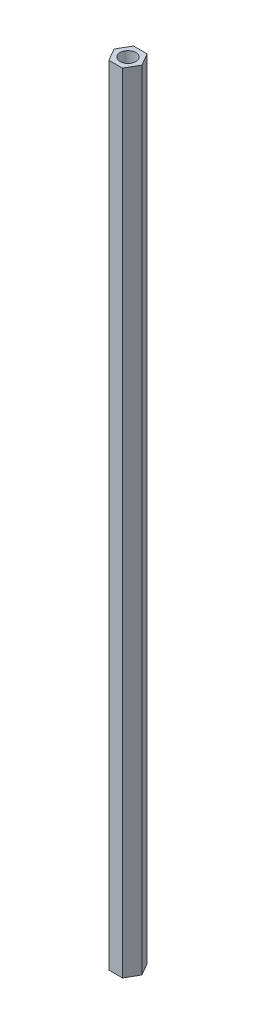
ISO-10303-21;
HEADER;
FILE_DESCRIPTION(('STEP AP214'),'2;1');
FILE_NAME('part.step','',(''),(''),'','','');
FILE_SCHEMA(('AUTOMOTIVE_DESIGN { 1 0 10303 214 1 1 1 1 }'));
ENDSEC;
DATA;
#1=APPLICATION_CONTEXT('core data for automotive mechanical design processes');
#2=APPLICATION_PROTOCOL_DEFINITION('international standard','automotive_design',2000,#1);
#3=PRODUCT_CONTEXT('',#1,'mechanical');
#4=PRODUCT('Part','Part','',(#3));
#5=PRODUCT_RELATED_PRODUCT_CATEGORY('part','',(#4));
#6=PRODUCT_DEFINITION_FORMATION('','',#4);
#7=PRODUCT_DEFINITION_CONTEXT('part definition',#1,'design');
#8=PRODUCT_DEFINITION('design','',#6,#7);
#9=PRODUCT_DEFINITION_SHAPE('','',#8);
#10=(LENGTH_UNIT() NAMED_UNIT(*) SI_UNIT(.MILLI.,.METRE.));
#11=(NAMED_UNIT(*) PLANE_ANGLE_UNIT() SI_UNIT($,.RADIAN.));
#12=(NAMED_UNIT(*) SI_UNIT($,.STERADIAN.) SOLID_ANGLE_UNIT());
#13=UNCERTAINTY_MEASURE_WITH_UNIT(LENGTH_MEASURE(1.E-05),#10,'distance_accuracy_value','');
#14=(GEOMETRIC_REPRESENTATION_CONTEXT(3) GLOBAL_UNCERTAINTY_ASSIGNED_CONTEXT((#13)) GLOBAL_UNIT_ASSIGNED_CONTEXT((#10,
#11,#12)) REPRESENTATION_CONTEXT('',''));
#15=CARTESIAN_POINT('',(0.,0.,0.));
#16=DIRECTION('',(0.,0.,1.));
#17=DIRECTION('',(1.,0.,0.));
#18=AXIS2_PLACEMENT_3D('',#15,#16,#17);
#19=CARTESIAN_POINT('',(0.,150.,0.));
#20=DIRECTION('',(0.,1.,0.));
#21=DIRECTION('',(0.,0.,1.));
#22=AXIS2_PLACEMENT_3D('',#19,#20,#21);
#23=PLANE('',#22);
#24=DIRECTION('',(0.499999999999998,0.,0.86602540378444));
#25=VECTOR('',#24,1.);
#26=CARTESIAN_POINT('',(-1.29322686740439,150.,2.35));
#27=LINE('',#26,#25);
#28=CARTESIAN_POINT('',(-2.65,150.,0.));
#29=VERTEX_POINT('',#28);
#30=CARTESIAN_POINT('',(-1.29322686740439,150.,2.35));
#31=VERTEX_POINT('',#30);
#32=EDGE_CURVE('E146',#29,#31,#27,.T.);
#33=ORIENTED_EDGE('',*,*,#32,.T.);
#34=DIRECTION('',(1.,0.,0.));
#35=VECTOR('',#34,1.);
#36=CARTESIAN_POINT('',(1.29322686740439,150.,2.35));
#37=LINE('',#36,#35);
#38=CARTESIAN_POINT('',(1.29322686740439,150.,2.35));
#39=VERTEX_POINT('',#38);
#40=EDGE_CURVE('E94',#31,#39,#37,.T.);
#41=ORIENTED_EDGE('',*,*,#40,.T.);
#42=DIRECTION('',(0.499999999999998,0.,-0.86602540378444));
#43=VECTOR('',#42,1.);
#44=CARTESIAN_POINT('',(1.29322686740439,150.,2.35));
#45=LINE('',#44,#43);
#46=CARTESIAN_POINT('',(2.65,150.,0.));
#47=VERTEX_POINT('',#46);
#48=EDGE_CURVE('E107',#39,#47,#45,.T.);
#49=ORIENTED_EDGE('',*,*,#48,.T.);
#50=DIRECTION('',(-0.499999999999998,0.,-0.86602540378444));
#51=VECTOR('',#50,1.);
#52=CARTESIAN_POINT('',(1.29322686740439,150.,-2.35));
#53=LINE('',#52,#51);
#54=CARTESIAN_POINT('',(1.29322686740439,150.,-2.35));
#55=VERTEX_POINT('',#54);
#56=EDGE_CURVE('E101',#47,#55,#53,.T.);
#57=ORIENTED_EDGE('',*,*,#56,.T.);
#58=DIRECTION('',(-1.,0.,0.));
#59=VECTOR('',#58,1.);
#60=CARTESIAN_POINT('',(1.29322686740439,150.,-2.35));
#61=LINE('',#60,#59);
#62=CARTESIAN_POINT('',(-1.29322686740439,150.,-2.35));
#63=VERTEX_POINT('',#62);
#64=EDGE_CURVE('E105',#55,#63,#61,.T.);
#65=ORIENTED_EDGE('',*,*,#64,.T.);
#66=DIRECTION('',(-0.499999999999998,0.,0.86602540378444));
#67=VECTOR('',#66,1.);
#68=CARTESIAN_POINT('',(-1.29322686740439,150.,-2.35));
#69=LINE('',#68,#67);
#70=EDGE_CURVE('E57',#63,#29,#69,.T.);
#71=ORIENTED_EDGE('',*,*,#70,.T.);
#72=EDGE_LOOP('',(#33,#41,#49,#57,#65,#71));
#73=FACE_BOUND('',#72,.T.);
#74=CARTESIAN_POINT('',(0.,150.,0.));
#75=DIRECTION('',(0.,1.,0.));
#76=DIRECTION('',(0.,0.,1.));
#77=AXIS2_PLACEMENT_3D('',#74,#75,#76);
#78=CIRCLE('',#77,1.5);
#79=CARTESIAN_POINT('',(0.,150.,1.5));
#80=VERTEX_POINT('',#79);
#81=EDGE_CURVE('E134',#80,#80,#78,.T.);
#82=ORIENTED_EDGE('',*,*,#81,.F.);
#83=EDGE_LOOP('',(#82));
#84=FACE_BOUND('',#83,.T.);
#85=ADVANCED_FACE('F39',(#73,#84),#23,.T.);
#86=CARTESIAN_POINT('',(0.,0.,0.));
#87=DIRECTION('',(0.,1.,0.));
#88=DIRECTION('',(0.,0.,1.));
#89=AXIS2_PLACEMENT_3D('',#86,#87,#88);
#90=PLANE('',#89);
#91=DIRECTION('',(0.499999999999998,0.,0.86602540378444));
#92=VECTOR('',#91,1.);
#93=CARTESIAN_POINT('',(-1.29322686740439,0.,2.35));
#94=LINE('',#93,#92);
#95=CARTESIAN_POINT('',(-2.65,0.,0.));
#96=VERTEX_POINT('',#95);
#97=CARTESIAN_POINT('',(-1.29322686740439,0.,2.35));
#98=VERTEX_POINT('',#97);
#99=EDGE_CURVE('E129',#96,#98,#94,.T.);
#100=ORIENTED_EDGE('',*,*,#99,.F.);
#101=DIRECTION('',(-0.499999999999998,0.,0.86602540378444));
#102=VECTOR('',#101,1.);
#103=CARTESIAN_POINT('',(-1.29322686740439,0.,-2.35));
#104=LINE('',#103,#102);
#105=CARTESIAN_POINT('',(-1.29322686740439,0.,-2.35));
#106=VERTEX_POINT('',#105);
#107=EDGE_CURVE('E86',#106,#96,#104,.T.);
#108=ORIENTED_EDGE('',*,*,#107,.F.);
#109=DIRECTION('',(-1.,0.,0.));
#110=VECTOR('',#109,1.);
#111=CARTESIAN_POINT('',(1.29322686740439,0.,-2.35));
#112=LINE('',#111,#110);
#113=CARTESIAN_POINT('',(1.29322686740439,0.,-2.35));
#114=VERTEX_POINT('',#113);
#115=EDGE_CURVE('E80',#114,#106,#112,.T.);
#116=ORIENTED_EDGE('',*,*,#115,.F.);
#117=DIRECTION('',(-0.499999999999998,0.,-0.86602540378444));
#118=VECTOR('',#117,1.);
#119=CARTESIAN_POINT('',(1.29322686740439,0.,-2.35));
#120=LINE('',#119,#118);
#121=CARTESIAN_POINT('',(2.65,0.,0.));
#122=VERTEX_POINT('',#121);
#123=EDGE_CURVE('E116',#122,#114,#120,.T.);
#124=ORIENTED_EDGE('',*,*,#123,.F.);
#125=DIRECTION('',(0.499999999999998,0.,-0.86602540378444));
#126=VECTOR('',#125,1.);
#127=CARTESIAN_POINT('',(1.29322686740439,0.,2.35));
#128=LINE('',#127,#126);
#129=CARTESIAN_POINT('',(1.29322686740439,0.,2.35));
#130=VERTEX_POINT('',#129);
#131=EDGE_CURVE('E137',#130,#122,#128,.T.);
#132=ORIENTED_EDGE('',*,*,#131,.F.);
#133=DIRECTION('',(1.,0.,0.));
#134=VECTOR('',#133,1.);
#135=CARTESIAN_POINT('',(1.29322686740439,0.,2.35));
#136=LINE('',#135,#134);
#137=EDGE_CURVE('E133',#98,#130,#136,.T.);
#138=ORIENTED_EDGE('',*,*,#137,.F.);
#139=EDGE_LOOP('',(#100,#108,#116,#124,#132,#138));
#140=FACE_BOUND('',#139,.T.);
#141=CARTESIAN_POINT('',(0.,0.,0.));
#142=DIRECTION('',(0.,1.,0.));
#143=DIRECTION('',(0.,0.,1.));
#144=AXIS2_PLACEMENT_3D('',#141,#142,#143);
#145=CIRCLE('',#144,1.5);
#146=CARTESIAN_POINT('',(0.,0.,1.5));
#147=VERTEX_POINT('',#146);
#148=EDGE_CURVE('E243',#147,#147,#145,.T.);
#149=ORIENTED_EDGE('',*,*,#148,.T.);
#150=EDGE_LOOP('',(#149));
#151=FACE_BOUND('',#150,.T.);
#152=ADVANCED_FACE('F159',(#140,#151),#90,.F.);
#153=CARTESIAN_POINT('',(-1.29322686740439,150.,2.35));
#154=DIRECTION('',(0.86602540378444,0.,-0.499999999999998));
#155=DIRECTION('',(-0.499999999999998,0.,-0.86602540378444));
#156=AXIS2_PLACEMENT_3D('',#153,#154,#155);
#157=PLANE('',#156);
#158=ORIENTED_EDGE('',*,*,#99,.T.);
#159=DIRECTION('',(0.,-1.,0.));
#160=VECTOR('',#159,1.);
#161=CARTESIAN_POINT('',(-1.29322686740439,150.,2.35));
#162=LINE('',#161,#160);
#163=EDGE_CURVE('E11',#31,#98,#162,.T.);
#164=ORIENTED_EDGE('',*,*,#163,.F.);
#165=ORIENTED_EDGE('',*,*,#32,.F.);
#166=DIRECTION('',(0.,-1.,0.));
#167=VECTOR('',#166,1.);
#168=CARTESIAN_POINT('',(-2.65,150.,0.));
#169=LINE('',#168,#167);
#170=EDGE_CURVE('E125',#29,#96,#169,.T.);
#171=ORIENTED_EDGE('',*,*,#170,.T.);
#172=EDGE_LOOP('',(#158,#164,#165,#171));
#173=FACE_BOUND('',#172,.T.);
#174=ADVANCED_FACE('F41',(#173),#157,.F.);
#175=CARTESIAN_POINT('',(1.29322686740439,150.,2.35));
#176=DIRECTION('',(0.,0.,-1.));
#177=DIRECTION('',(-1.,0.,0.));
#178=AXIS2_PLACEMENT_3D('',#175,#176,#177);
#179=PLANE('',#178);
#180=ORIENTED_EDGE('',*,*,#137,.T.);
#181=DIRECTION('',(0.,-1.,0.));
#182=VECTOR('',#181,1.);
#183=CARTESIAN_POINT('',(1.29322686740439,150.,2.35));
#184=LINE('',#183,#182);
#185=EDGE_CURVE('E49',#39,#130,#184,.T.);
#186=ORIENTED_EDGE('',*,*,#185,.F.);
#187=ORIENTED_EDGE('',*,*,#40,.F.);
#188=ORIENTED_EDGE('',*,*,#163,.T.);
#189=EDGE_LOOP('',(#180,#186,#187,#188));
#190=FACE_BOUND('',#189,.T.);
#191=ADVANCED_FACE('F184',(#190),#179,.F.);
#192=CARTESIAN_POINT('',(1.29322686740439,150.,2.35));
#193=DIRECTION('',(-0.86602540378444,0.,-0.499999999999998));
#194=DIRECTION('',(-0.499999999999998,0.,0.86602540378444));
#195=AXIS2_PLACEMENT_3D('',#192,#193,#194);
#196=PLANE('',#195);
#197=ORIENTED_EDGE('',*,*,#131,.T.);
#198=DIRECTION('',(0.,-1.,0.));
#199=VECTOR('',#198,1.);
#200=CARTESIAN_POINT('',(2.65,150.,0.));
#201=LINE('',#200,#199);
#202=EDGE_CURVE('E118',#47,#122,#201,.T.);
#203=ORIENTED_EDGE('',*,*,#202,.F.);
#204=ORIENTED_EDGE('',*,*,#48,.F.);
#205=ORIENTED_EDGE('',*,*,#185,.T.);
#206=EDGE_LOOP('',(#197,#203,#204,#205));
#207=FACE_BOUND('',#206,.T.);
#208=ADVANCED_FACE('F156',(#207),#196,.F.);
#209=CARTESIAN_POINT('',(1.29322686740439,150.,-2.35));
#210=DIRECTION('',(-0.86602540378444,0.,0.499999999999998));
#211=DIRECTION('',(0.499999999999998,0.,0.86602540378444));
#212=AXIS2_PLACEMENT_3D('',#209,#210,#211);
#213=PLANE('',#212);
#214=ORIENTED_EDGE('',*,*,#123,.T.);
#215=DIRECTION('',(0.,-1.,0.));
#216=VECTOR('',#215,1.);
#217=CARTESIAN_POINT('',(1.29322686740439,150.,-2.35));
#218=LINE('',#217,#216);
#219=EDGE_CURVE('E113',#55,#114,#218,.T.);
#220=ORIENTED_EDGE('',*,*,#219,.F.);
#221=ORIENTED_EDGE('',*,*,#56,.F.);
#222=ORIENTED_EDGE('',*,*,#202,.T.);
#223=EDGE_LOOP('',(#214,#220,#221,#222));
#224=FACE_BOUND('',#223,.T.);
#225=ADVANCED_FACE('F114',(#224),#213,.F.);
#226=CARTESIAN_POINT('',(1.29322686740439,150.,-2.35));
#227=DIRECTION('',(0.,0.,1.));
#228=DIRECTION('',(1.,0.,0.));
#229=AXIS2_PLACEMENT_3D('',#226,#227,#228);
#230=PLANE('',#229);
#231=ORIENTED_EDGE('',*,*,#115,.T.);
#232=DIRECTION('',(0.,-1.,0.));
#233=VECTOR('',#232,1.);
#234=CARTESIAN_POINT('',(-1.29322686740439,150.,-2.35));
#235=LINE('',#234,#233);
#236=EDGE_CURVE('E119',#63,#106,#235,.T.);
#237=ORIENTED_EDGE('',*,*,#236,.F.);
#238=ORIENTED_EDGE('',*,*,#64,.F.);
#239=ORIENTED_EDGE('',*,*,#219,.T.);
#240=EDGE_LOOP('',(#231,#237,#238,#239));
#241=FACE_BOUND('',#240,.T.);
#242=ADVANCED_FACE('F121',(#241),#230,.F.);
#243=CARTESIAN_POINT('',(-1.29322686740439,150.,-2.35));
#244=DIRECTION('',(0.86602540378444,0.,0.499999999999998));
#245=DIRECTION('',(0.499999999999998,0.,-0.86602540378444));
#246=AXIS2_PLACEMENT_3D('',#243,#244,#245);
#247=PLANE('',#246);
#248=ORIENTED_EDGE('',*,*,#107,.T.);
#249=ORIENTED_EDGE('',*,*,#170,.F.);
#250=ORIENTED_EDGE('',*,*,#70,.F.);
#251=ORIENTED_EDGE('',*,*,#236,.T.);
#252=EDGE_LOOP('',(#248,#249,#250,#251));
#253=FACE_BOUND('',#252,.T.);
#254=ADVANCED_FACE('F164',(#253),#247,.F.);
#255=CARTESIAN_POINT('',(0.,150.,0.));
#256=DIRECTION('',(0.,-1.,0.));
#257=DIRECTION('',(0.,0.,-1.));
#258=AXIS2_PLACEMENT_3D('',#255,#256,#257);
#259=CYLINDRICAL_SURFACE('',#258,1.5);
#260=ORIENTED_EDGE('',*,*,#81,.T.);
#261=EDGE_LOOP('',(#260));
#262=FACE_BOUND('',#261,.T.);
#263=ORIENTED_EDGE('',*,*,#148,.F.);
#264=EDGE_LOOP('',(#263));
#265=FACE_BOUND('',#264,.T.);
#266=ADVANCED_FACE('F166',(#262,#265),#259,.F.);
#267=CLOSED_SHELL('',(#85,#152,#174,#191,#208,#225,#242,#254,#266));
#268=MANIFOLD_SOLID_BREP('B2',#267);
#269=ADVANCED_BREP_SHAPE_REPRESENTATION('',(#18,#268),#14);
#270=SHAPE_DEFINITION_REPRESENTATION(#9,#269);
ENDSEC;
END-ISO-10303-21;
